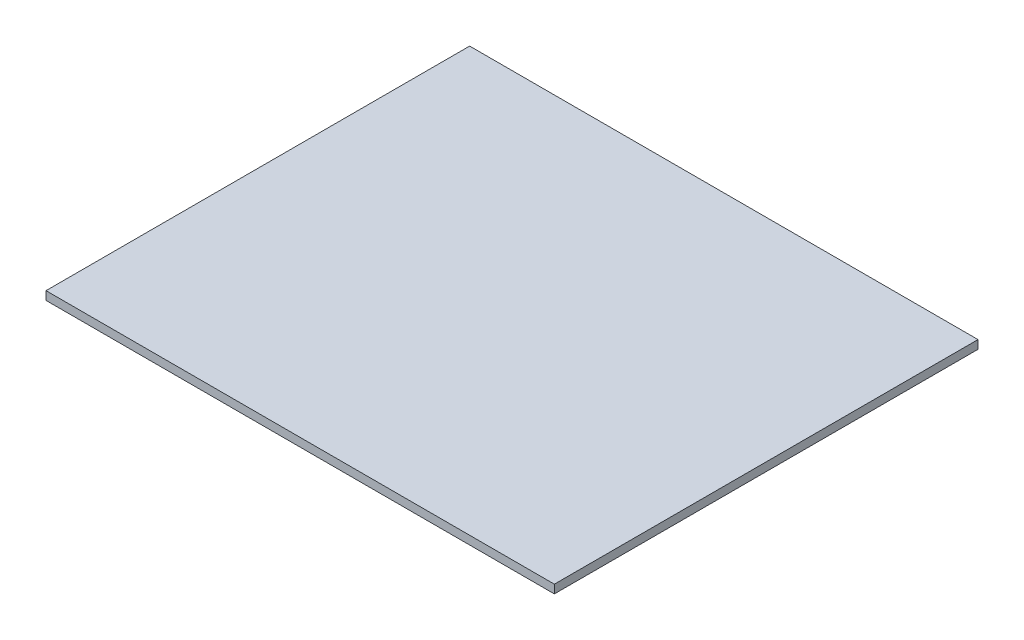
ISO-10303-21;
HEADER;
FILE_DESCRIPTION(('STEP AP214'),'2;1');
FILE_NAME('part.step','',(''),(''),'','','');
FILE_SCHEMA(('AUTOMOTIVE_DESIGN { 1 0 10303 214 1 1 1 1 }'));
ENDSEC;
DATA;
#1=APPLICATION_CONTEXT('core data for automotive mechanical design processes');
#2=APPLICATION_PROTOCOL_DEFINITION('international standard','automotive_design',2000,#1);
#3=PRODUCT_CONTEXT('',#1,'mechanical');
#4=PRODUCT('Part','Part','',(#3));
#5=PRODUCT_RELATED_PRODUCT_CATEGORY('part','',(#4));
#6=PRODUCT_DEFINITION_FORMATION('','',#4);
#7=PRODUCT_DEFINITION_CONTEXT('part definition',#1,'design');
#8=PRODUCT_DEFINITION('design','',#6,#7);
#9=PRODUCT_DEFINITION_SHAPE('','',#8);
#10=(LENGTH_UNIT() NAMED_UNIT(*) SI_UNIT(.MILLI.,.METRE.));
#11=(NAMED_UNIT(*) PLANE_ANGLE_UNIT() SI_UNIT($,.RADIAN.));
#12=(NAMED_UNIT(*) SI_UNIT($,.STERADIAN.) SOLID_ANGLE_UNIT());
#13=UNCERTAINTY_MEASURE_WITH_UNIT(LENGTH_MEASURE(1.E-05),#10,'distance_accuracy_value','');
#14=(GEOMETRIC_REPRESENTATION_CONTEXT(3) GLOBAL_UNCERTAINTY_ASSIGNED_CONTEXT((#13)) GLOBAL_UNIT_ASSIGNED_CONTEXT((#10,
#11,#12)) REPRESENTATION_CONTEXT('',''));
#15=CARTESIAN_POINT('',(0.,0.,0.));
#16=DIRECTION('',(0.,0.,1.));
#17=DIRECTION('',(1.,0.,0.));
#18=AXIS2_PLACEMENT_3D('',#15,#16,#17);
#19=CARTESIAN_POINT('',(-0.6,0.02,-0.5));
#20=DIRECTION('',(1.,0.,0.));
#21=DIRECTION('',(0.,0.,-1.));
#22=AXIS2_PLACEMENT_3D('',#19,#20,#21);
#23=PLANE('',#22);
#24=DIRECTION('',(0.,0.,1.));
#25=VECTOR('',#24,1.);
#26=CARTESIAN_POINT('',(-0.6,0.,-0.5));
#27=LINE('',#26,#25);
#28=CARTESIAN_POINT('',(-0.6,0.,-0.5));
#29=VERTEX_POINT('',#28);
#30=CARTESIAN_POINT('',(-0.599999999999996,0.,0.5));
#31=VERTEX_POINT('',#30);
#32=EDGE_CURVE('E96',#29,#31,#27,.T.);
#33=ORIENTED_EDGE('',*,*,#32,.T.);
#34=DIRECTION('',(0.,-1.,0.));
#35=VECTOR('',#34,1.);
#36=CARTESIAN_POINT('',(-0.599999999999996,0.02,0.5));
#37=LINE('',#36,#35);
#38=CARTESIAN_POINT('',(-0.599999999999996,0.02,0.5));
#39=VERTEX_POINT('',#38);
#40=EDGE_CURVE('E11',#39,#31,#37,.T.);
#41=ORIENTED_EDGE('',*,*,#40,.F.);
#42=DIRECTION('',(0.,0.,1.));
#43=VECTOR('',#42,1.);
#44=CARTESIAN_POINT('',(-0.6,0.02,-0.5));
#45=LINE('',#44,#43);
#46=CARTESIAN_POINT('',(-0.6,0.02,-0.5));
#47=VERTEX_POINT('',#46);
#48=EDGE_CURVE('E82',#47,#39,#45,.T.);
#49=ORIENTED_EDGE('',*,*,#48,.F.);
#50=DIRECTION('',(0.,-1.,0.));
#51=VECTOR('',#50,1.);
#52=CARTESIAN_POINT('',(-0.6,0.02,-0.5));
#53=LINE('',#52,#51);
#54=EDGE_CURVE('E49',#47,#29,#53,.T.);
#55=ORIENTED_EDGE('',*,*,#54,.T.);
#56=EDGE_LOOP('',(#33,#41,#49,#55));
#57=FACE_BOUND('',#56,.T.);
#58=ADVANCED_FACE('F33',(#57),#23,.F.);
#59=CARTESIAN_POINT('',(-0.599999999999996,0.02,0.5));
#60=DIRECTION('',(0.,0.,-1.));
#61=DIRECTION('',(-1.,0.,0.));
#62=AXIS2_PLACEMENT_3D('',#59,#60,#61);
#63=PLANE('',#62);
#64=DIRECTION('',(1.,0.,0.));
#65=VECTOR('',#64,1.);
#66=CARTESIAN_POINT('',(-0.599999999999996,0.,0.5));
#67=LINE('',#66,#65);
#68=CARTESIAN_POINT('',(0.6,0.,0.5));
#69=VERTEX_POINT('',#68);
#70=EDGE_CURVE('E87',#31,#69,#67,.T.);
#71=ORIENTED_EDGE('',*,*,#70,.T.);
#72=DIRECTION('',(0.,-1.,0.));
#73=VECTOR('',#72,1.);
#74=CARTESIAN_POINT('',(0.6,0.02,0.5));
#75=LINE('',#74,#73);
#76=CARTESIAN_POINT('',(0.6,0.02,0.5));
#77=VERTEX_POINT('',#76);
#78=EDGE_CURVE('E41',#77,#69,#75,.T.);
#79=ORIENTED_EDGE('',*,*,#78,.F.);
#80=DIRECTION('',(1.,0.,0.));
#81=VECTOR('',#80,1.);
#82=CARTESIAN_POINT('',(-0.599999999999996,0.02,0.5));
#83=LINE('',#82,#81);
#84=EDGE_CURVE('E74',#39,#77,#83,.T.);
#85=ORIENTED_EDGE('',*,*,#84,.F.);
#86=ORIENTED_EDGE('',*,*,#40,.T.);
#87=EDGE_LOOP('',(#71,#79,#85,#86));
#88=FACE_BOUND('',#87,.T.);
#89=ADVANCED_FACE('F86',(#88),#63,.F.);
#90=CARTESIAN_POINT('',(0.6,0.02,-0.5));
#91=DIRECTION('',(1.,0.,0.));
#92=DIRECTION('',(0.,0.,-1.));
#93=AXIS2_PLACEMENT_3D('',#90,#91,#92);
#94=PLANE('',#93);
#95=DIRECTION('',(0.,0.,1.));
#96=VECTOR('',#95,1.);
#97=CARTESIAN_POINT('',(0.6,0.,-0.5));
#98=LINE('',#97,#96);
#99=CARTESIAN_POINT('',(0.6,0.,-0.5));
#100=VERTEX_POINT('',#99);
#101=EDGE_CURVE('E99',#100,#69,#98,.T.);
#102=ORIENTED_EDGE('',*,*,#101,.F.);
#103=DIRECTION('',(0.,-1.,0.));
#104=VECTOR('',#103,1.);
#105=CARTESIAN_POINT('',(0.6,0.02,-0.5));
#106=LINE('',#105,#104);
#107=CARTESIAN_POINT('',(0.6,0.02,-0.5));
#108=VERTEX_POINT('',#107);
#109=EDGE_CURVE('E63',#108,#100,#106,.T.);
#110=ORIENTED_EDGE('',*,*,#109,.F.);
#111=DIRECTION('',(0.,0.,1.));
#112=VECTOR('',#111,1.);
#113=CARTESIAN_POINT('',(0.6,0.02,-0.5));
#114=LINE('',#113,#112);
#115=EDGE_CURVE('E81',#108,#77,#114,.T.);
#116=ORIENTED_EDGE('',*,*,#115,.T.);
#117=ORIENTED_EDGE('',*,*,#78,.T.);
#118=EDGE_LOOP('',(#102,#110,#116,#117));
#119=FACE_BOUND('',#118,.T.);
#120=ADVANCED_FACE('F90',(#119),#94,.T.);
#121=CARTESIAN_POINT('',(-0.6,0.02,-0.5));
#122=DIRECTION('',(0.,0.,-1.));
#123=DIRECTION('',(-1.,0.,0.));
#124=AXIS2_PLACEMENT_3D('',#121,#122,#123);
#125=PLANE('',#124);
#126=DIRECTION('',(1.,0.,0.));
#127=VECTOR('',#126,1.);
#128=CARTESIAN_POINT('',(-0.6,0.,-0.5));
#129=LINE('',#128,#127);
#130=EDGE_CURVE('E101',#29,#100,#129,.T.);
#131=ORIENTED_EDGE('',*,*,#130,.F.);
#132=ORIENTED_EDGE('',*,*,#54,.F.);
#133=DIRECTION('',(1.,0.,0.));
#134=VECTOR('',#133,1.);
#135=CARTESIAN_POINT('',(-0.6,0.02,-0.5));
#136=LINE('',#135,#134);
#137=EDGE_CURVE('E91',#47,#108,#136,.T.);
#138=ORIENTED_EDGE('',*,*,#137,.T.);
#139=ORIENTED_EDGE('',*,*,#109,.T.);
#140=EDGE_LOOP('',(#131,#132,#138,#139));
#141=FACE_BOUND('',#140,.T.);
#142=ADVANCED_FACE('F107',(#141),#125,.T.);
#143=CARTESIAN_POINT('',(0.,0.02,0.));
#144=DIRECTION('',(0.,1.,0.));
#145=DIRECTION('',(0.,0.,1.));
#146=AXIS2_PLACEMENT_3D('',#143,#144,#145);
#147=PLANE('',#146);
#148=ORIENTED_EDGE('',*,*,#48,.T.);
#149=ORIENTED_EDGE('',*,*,#84,.T.);
#150=ORIENTED_EDGE('',*,*,#115,.F.);
#151=ORIENTED_EDGE('',*,*,#137,.F.);
#152=EDGE_LOOP('',(#148,#149,#150,#151));
#153=FACE_BOUND('',#152,.T.);
#154=ADVANCED_FACE('F78',(#153),#147,.T.);
#155=CARTESIAN_POINT('',(0.,0.,0.));
#156=DIRECTION('',(0.,1.,0.));
#157=DIRECTION('',(0.,0.,1.));
#158=AXIS2_PLACEMENT_3D('',#155,#156,#157);
#159=PLANE('',#158);
#160=ORIENTED_EDGE('',*,*,#32,.F.);
#161=ORIENTED_EDGE('',*,*,#130,.T.);
#162=ORIENTED_EDGE('',*,*,#101,.T.);
#163=ORIENTED_EDGE('',*,*,#70,.F.);
#164=EDGE_LOOP('',(#160,#161,#162,#163));
#165=FACE_BOUND('',#164,.T.);
#166=ADVANCED_FACE('F106',(#165),#159,.F.);
#167=CLOSED_SHELL('',(#58,#89,#120,#142,#154,#166));
#168=MANIFOLD_SOLID_BREP('B2',#167);
#169=ADVANCED_BREP_SHAPE_REPRESENTATION('',(#18,#168),#14);
#170=SHAPE_DEFINITION_REPRESENTATION(#9,#169);
ENDSEC;
END-ISO-10303-21;
